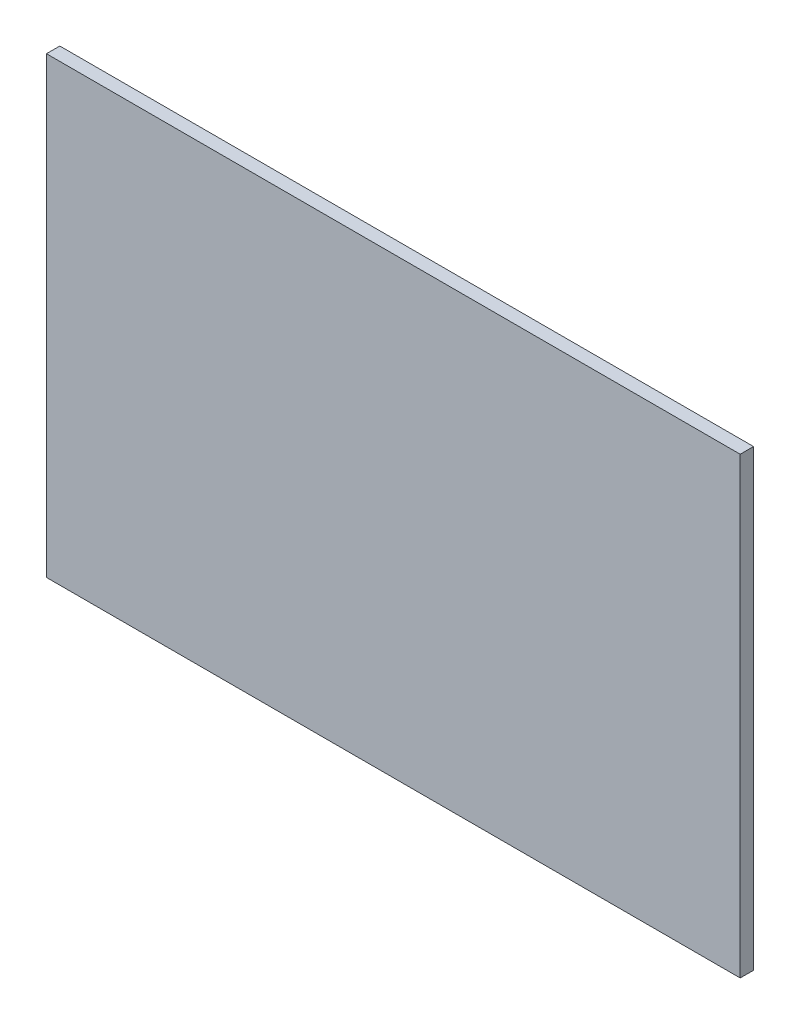
ISO-10303-21;
HEADER;
FILE_DESCRIPTION(('STEP AP214'),'2;1');
FILE_NAME('part.step','',(''),(''),'','','');
FILE_SCHEMA(('AUTOMOTIVE_DESIGN { 1 0 10303 214 1 1 1 1 }'));
ENDSEC;
DATA;
#1=APPLICATION_CONTEXT('core data for automotive mechanical design processes');
#2=APPLICATION_PROTOCOL_DEFINITION('international standard','automotive_design',2000,#1);
#3=PRODUCT_CONTEXT('',#1,'mechanical');
#4=PRODUCT('Part','Part','',(#3));
#5=PRODUCT_RELATED_PRODUCT_CATEGORY('part','',(#4));
#6=PRODUCT_DEFINITION_FORMATION('','',#4);
#7=PRODUCT_DEFINITION_CONTEXT('part definition',#1,'design');
#8=PRODUCT_DEFINITION('design','',#6,#7);
#9=PRODUCT_DEFINITION_SHAPE('','',#8);
#10=(LENGTH_UNIT() NAMED_UNIT(*) SI_UNIT(.MILLI.,.METRE.));
#11=(NAMED_UNIT(*) PLANE_ANGLE_UNIT() SI_UNIT($,.RADIAN.));
#12=(NAMED_UNIT(*) SI_UNIT($,.STERADIAN.) SOLID_ANGLE_UNIT());
#13=UNCERTAINTY_MEASURE_WITH_UNIT(LENGTH_MEASURE(1.E-05),#10,'distance_accuracy_value','');
#14=(GEOMETRIC_REPRESENTATION_CONTEXT(3) GLOBAL_UNCERTAINTY_ASSIGNED_CONTEXT((#13)) GLOBAL_UNIT_ASSIGNED_CONTEXT((#10,
#11,#12)) REPRESENTATION_CONTEXT('',''));
#15=CARTESIAN_POINT('',(0.,0.,0.));
#16=DIRECTION('',(0.,0.,1.));
#17=DIRECTION('',(1.,0.,0.));
#18=AXIS2_PLACEMENT_3D('',#15,#16,#17);
#19=CARTESIAN_POINT('',(165.1,-107.95,3.175));
#20=DIRECTION('',(-1.,0.,0.));
#21=DIRECTION('',(0.,0.,1.));
#22=AXIS2_PLACEMENT_3D('',#19,#20,#21);
#23=PLANE('',#22);
#24=DIRECTION('',(0.,1.,0.));
#25=VECTOR('',#24,1.);
#26=CARTESIAN_POINT('',(165.1,-107.95,-3.175));
#27=LINE('',#26,#25);
#28=CARTESIAN_POINT('',(165.1,-107.95,-3.175));
#29=VERTEX_POINT('',#28);
#30=CARTESIAN_POINT('',(165.1,107.95,-3.175));
#31=VERTEX_POINT('',#30);
#32=EDGE_CURVE('E98',#29,#31,#27,.T.);
#33=ORIENTED_EDGE('',*,*,#32,.T.);
#34=DIRECTION('',(0.,0.,-1.));
#35=VECTOR('',#34,1.);
#36=CARTESIAN_POINT('',(165.1,107.95,3.175));
#37=LINE('',#36,#35);
#38=CARTESIAN_POINT('',(165.1,107.95,3.175));
#39=VERTEX_POINT('',#38);
#40=EDGE_CURVE('E11',#39,#31,#37,.T.);
#41=ORIENTED_EDGE('',*,*,#40,.F.);
#42=DIRECTION('',(0.,1.,0.));
#43=VECTOR('',#42,1.);
#44=CARTESIAN_POINT('',(165.1,-107.95,3.175));
#45=LINE('',#44,#43);
#46=CARTESIAN_POINT('',(165.1,-107.95,3.175));
#47=VERTEX_POINT('',#46);
#48=EDGE_CURVE('E86',#47,#39,#45,.T.);
#49=ORIENTED_EDGE('',*,*,#48,.F.);
#50=DIRECTION('',(0.,0.,-1.));
#51=VECTOR('',#50,1.);
#52=CARTESIAN_POINT('',(165.1,-107.95,3.175));
#53=LINE('',#52,#51);
#54=EDGE_CURVE('E94',#47,#29,#53,.T.);
#55=ORIENTED_EDGE('',*,*,#54,.T.);
#56=EDGE_LOOP('',(#33,#41,#49,#55));
#57=FACE_BOUND('',#56,.T.);
#58=ADVANCED_FACE('F35',(#57),#23,.F.);
#59=CARTESIAN_POINT('',(-165.1,107.95,3.175));
#60=DIRECTION('',(0.,-1.,0.));
#61=DIRECTION('',(0.,0.,-1.));
#62=AXIS2_PLACEMENT_3D('',#59,#60,#61);
#63=PLANE('',#62);
#64=DIRECTION('',(-1.,0.,0.));
#65=VECTOR('',#64,1.);
#66=CARTESIAN_POINT('',(-165.1,107.95,-3.175));
#67=LINE('',#66,#65);
#68=CARTESIAN_POINT('',(-165.1,107.95,-3.175));
#69=VERTEX_POINT('',#68);
#70=EDGE_CURVE('E90',#31,#69,#67,.T.);
#71=ORIENTED_EDGE('',*,*,#70,.T.);
#72=DIRECTION('',(0.,0.,-1.));
#73=VECTOR('',#72,1.);
#74=CARTESIAN_POINT('',(-165.1,107.95,3.175));
#75=LINE('',#74,#73);
#76=CARTESIAN_POINT('',(-165.1,107.95,3.175));
#77=VERTEX_POINT('',#76);
#78=EDGE_CURVE('E43',#77,#69,#75,.T.);
#79=ORIENTED_EDGE('',*,*,#78,.F.);
#80=DIRECTION('',(-1.,0.,0.));
#81=VECTOR('',#80,1.);
#82=CARTESIAN_POINT('',(-165.1,107.95,3.175));
#83=LINE('',#82,#81);
#84=EDGE_CURVE('E81',#39,#77,#83,.T.);
#85=ORIENTED_EDGE('',*,*,#84,.F.);
#86=ORIENTED_EDGE('',*,*,#40,.T.);
#87=EDGE_LOOP('',(#71,#79,#85,#86));
#88=FACE_BOUND('',#87,.T.);
#89=ADVANCED_FACE('F89',(#88),#63,.F.);
#90=CARTESIAN_POINT('',(-165.1,-107.95,3.175));
#91=DIRECTION('',(1.,0.,0.));
#92=DIRECTION('',(0.,0.,-1.));
#93=AXIS2_PLACEMENT_3D('',#90,#91,#92);
#94=PLANE('',#93);
#95=DIRECTION('',(0.,-1.,0.));
#96=VECTOR('',#95,1.);
#97=CARTESIAN_POINT('',(-165.1,-107.95,-3.175));
#98=LINE('',#97,#96);
#99=CARTESIAN_POINT('',(-165.1,-107.95,-3.175));
#100=VERTEX_POINT('',#99);
#101=EDGE_CURVE('E68',#69,#100,#98,.T.);
#102=ORIENTED_EDGE('',*,*,#101,.T.);
#103=DIRECTION('',(0.,0.,-1.));
#104=VECTOR('',#103,1.);
#105=CARTESIAN_POINT('',(-165.1,-107.95,3.175));
#106=LINE('',#105,#104);
#107=CARTESIAN_POINT('',(-165.1,-107.95,3.175));
#108=VERTEX_POINT('',#107);
#109=EDGE_CURVE('E91',#108,#100,#106,.T.);
#110=ORIENTED_EDGE('',*,*,#109,.F.);
#111=DIRECTION('',(0.,-1.,0.));
#112=VECTOR('',#111,1.);
#113=CARTESIAN_POINT('',(-165.1,-107.95,3.175));
#114=LINE('',#113,#112);
#115=EDGE_CURVE('E84',#77,#108,#114,.T.);
#116=ORIENTED_EDGE('',*,*,#115,.F.);
#117=ORIENTED_EDGE('',*,*,#78,.T.);
#118=EDGE_LOOP('',(#102,#110,#116,#117));
#119=FACE_BOUND('',#118,.T.);
#120=ADVANCED_FACE('F92',(#119),#94,.F.);
#121=CARTESIAN_POINT('',(-165.1,-107.95,3.175));
#122=DIRECTION('',(0.,1.,0.));
#123=DIRECTION('',(0.,0.,1.));
#124=AXIS2_PLACEMENT_3D('',#121,#122,#123);
#125=PLANE('',#124);
#126=DIRECTION('',(1.,0.,0.));
#127=VECTOR('',#126,1.);
#128=CARTESIAN_POINT('',(-165.1,-107.95,-3.175));
#129=LINE('',#128,#127);
#130=EDGE_CURVE('E74',#100,#29,#129,.T.);
#131=ORIENTED_EDGE('',*,*,#130,.T.);
#132=ORIENTED_EDGE('',*,*,#54,.F.);
#133=DIRECTION('',(1.,0.,0.));
#134=VECTOR('',#133,1.);
#135=CARTESIAN_POINT('',(-165.1,-107.95,3.175));
#136=LINE('',#135,#134);
#137=EDGE_CURVE('E51',#108,#47,#136,.T.);
#138=ORIENTED_EDGE('',*,*,#137,.F.);
#139=ORIENTED_EDGE('',*,*,#109,.T.);
#140=EDGE_LOOP('',(#131,#132,#138,#139));
#141=FACE_BOUND('',#140,.T.);
#142=ADVANCED_FACE('F105',(#141),#125,.F.);
#143=CARTESIAN_POINT('',(0.,0.,3.175));
#144=DIRECTION('',(0.,0.,-1.));
#145=DIRECTION('',(-1.,0.,0.));
#146=AXIS2_PLACEMENT_3D('',#143,#144,#145);
#147=PLANE('',#146);
#148=ORIENTED_EDGE('',*,*,#48,.T.);
#149=ORIENTED_EDGE('',*,*,#84,.T.);
#150=ORIENTED_EDGE('',*,*,#115,.T.);
#151=ORIENTED_EDGE('',*,*,#137,.T.);
#152=EDGE_LOOP('',(#148,#149,#150,#151));
#153=FACE_BOUND('',#152,.T.);
#154=ADVANCED_FACE('F82',(#153),#147,.F.);
#155=CARTESIAN_POINT('',(0.,0.,-3.175));
#156=DIRECTION('',(0.,0.,-1.));
#157=DIRECTION('',(-1.,0.,0.));
#158=AXIS2_PLACEMENT_3D('',#155,#156,#157);
#159=PLANE('',#158);
#160=ORIENTED_EDGE('',*,*,#32,.F.);
#161=ORIENTED_EDGE('',*,*,#130,.F.);
#162=ORIENTED_EDGE('',*,*,#101,.F.);
#163=ORIENTED_EDGE('',*,*,#70,.F.);
#164=EDGE_LOOP('',(#160,#161,#162,#163));
#165=FACE_BOUND('',#164,.T.);
#166=ADVANCED_FACE('F108',(#165),#159,.T.);
#167=CLOSED_SHELL('',(#58,#89,#120,#142,#154,#166));
#168=MANIFOLD_SOLID_BREP('B2',#167);
#169=ADVANCED_BREP_SHAPE_REPRESENTATION('',(#18,#168),#14);
#170=SHAPE_DEFINITION_REPRESENTATION(#9,#169);
ENDSEC;
END-ISO-10303-21;
